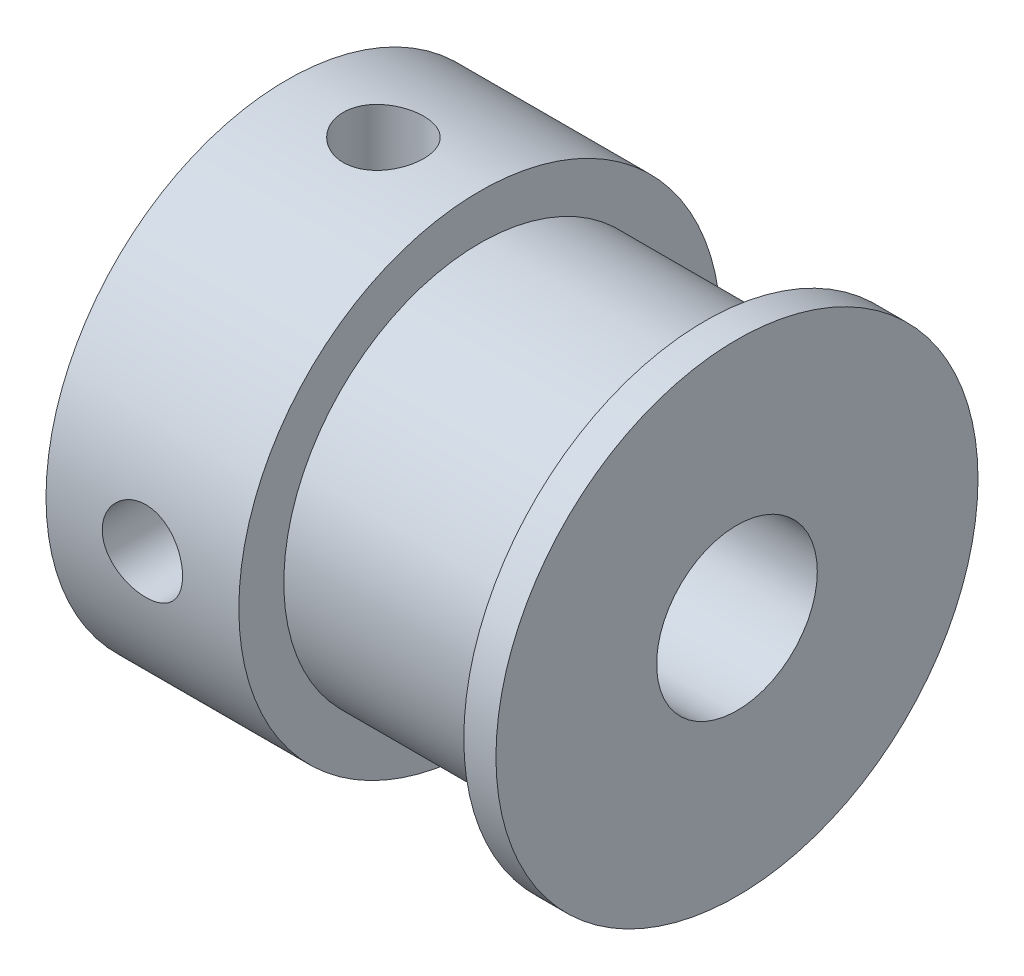
ISO-10303-21;
HEADER;
FILE_DESCRIPTION(('STEP AP214'),'2;1');
FILE_NAME('part.step','',(''),(''),'','','');
FILE_SCHEMA(('AUTOMOTIVE_DESIGN { 1 0 10303 214 1 1 1 1 }'));
ENDSEC;
DATA;
#1=APPLICATION_CONTEXT('core data for automotive mechanical design processes');
#2=APPLICATION_PROTOCOL_DEFINITION('international standard','automotive_design',2000,#1);
#3=PRODUCT_CONTEXT('',#1,'mechanical');
#4=PRODUCT('Part','Part','',(#3));
#5=PRODUCT_RELATED_PRODUCT_CATEGORY('part','',(#4));
#6=PRODUCT_DEFINITION_FORMATION('','',#4);
#7=PRODUCT_DEFINITION_CONTEXT('part definition',#1,'design');
#8=PRODUCT_DEFINITION('design','',#6,#7);
#9=PRODUCT_DEFINITION_SHAPE('','',#8);
#10=(LENGTH_UNIT() NAMED_UNIT(*) SI_UNIT(.MILLI.,.METRE.));
#11=(NAMED_UNIT(*) PLANE_ANGLE_UNIT() SI_UNIT($,.RADIAN.));
#12=(NAMED_UNIT(*) SI_UNIT($,.STERADIAN.) SOLID_ANGLE_UNIT());
#13=UNCERTAINTY_MEASURE_WITH_UNIT(LENGTH_MEASURE(1.E-05),#10,'distance_accuracy_value','');
#14=(GEOMETRIC_REPRESENTATION_CONTEXT(3) GLOBAL_UNCERTAINTY_ASSIGNED_CONTEXT((#13)) GLOBAL_UNIT_ASSIGNED_CONTEXT((#10,
#11,#12)) REPRESENTATION_CONTEXT('',''));
#15=CARTESIAN_POINT('',(0.,0.,0.));
#16=DIRECTION('',(0.,0.,1.));
#17=DIRECTION('',(1.,0.,0.));
#18=AXIS2_PLACEMENT_3D('',#15,#16,#17);
#19=CARTESIAN_POINT('',(0.,0.,0.));
#20=DIRECTION('',(1.,0.,0.));
#21=DIRECTION('',(0.,0.,-1.));
#22=AXIS2_PLACEMENT_3D('',#19,#20,#21);
#23=CYLINDRICAL_SURFACE('',#22,2.5);
#24=CARTESIAN_POINT('',(1.75000000000001,0.,2.5));
#25=CARTESIAN_POINT('',(1.75000412789938,0.0657149536912327,2.49999641755189));
#26=CARTESIAN_POINT('',(1.7552125914021,0.13150824962254,2.49738113774397));
#27=CARTESIAN_POINT('',(1.77581610042615,0.26115029408553,2.48717695046745));
#28=CARTESIAN_POINT('',(1.79123049124707,0.324995108391878,2.4795785978623));
#29=CARTESIAN_POINT('',(1.831492260771,0.448666931100716,2.4602034925414));
#30=CARTESIAN_POINT('',(1.85630298031002,0.508508503673972,2.448442989719));
#31=CARTESIAN_POINT('',(1.91446327670618,0.623090771008203,2.42182220644723));
#32=CARTESIAN_POINT('',(1.94781218031107,0.677831867487559,2.40696217041913));
#33=CARTESIAN_POINT('',(2.02439656185663,0.784384772202394,2.37445322822571));
#34=CARTESIAN_POINT('',(2.06810809904956,0.835819013902635,2.3566899890942));
#35=CARTESIAN_POINT('',(2.1631518490588,0.930974306083716,2.32074962808431));
#36=CARTESIAN_POINT('',(2.21448981471555,0.974689478883452,2.30257220261294));
#37=CARTESIAN_POINT('',(2.32810418690423,1.05656500056284,2.26623688996684));
#38=CARTESIAN_POINT('',(2.39092012293239,1.09403166943954,2.24818983712665));
#39=CARTESIAN_POINT('',(2.52295916998277,1.15771028361336,2.21607473465401));
#40=CARTESIAN_POINT('',(2.59217766090344,1.18393026870791,2.20200384508737));
#41=CARTESIAN_POINT('',(2.73083138177741,1.22266555273573,2.18072333797261));
#42=CARTESIAN_POINT('',(2.80000556508424,1.23590732135054,2.17315339479642));
#43=CARTESIAN_POINT('',(2.93997354722435,1.25053374163605,2.1647736243566));
#44=CARTESIAN_POINT('',(3.01076567608894,1.25193011046634,2.16395711679111));
#45=CARTESIAN_POINT('',(3.14285753039421,1.24335910896536,2.16888662821561));
#46=CARTESIAN_POINT('',(3.20428003902881,1.23473069942102,2.17385954577517));
#47=CARTESIAN_POINT('',(3.3246523867163,1.20867481132116,2.18845285917313));
#48=CARTESIAN_POINT('',(3.38360143163164,1.19124452987206,2.19807473539721));
#49=CARTESIAN_POINT('',(3.49903641570707,1.1477622254825,2.22109345515927));
#50=CARTESIAN_POINT('',(3.55543299848223,1.12151883389499,2.23457300829999));
#51=CARTESIAN_POINT('',(3.66329286573751,1.061302109585,2.26379255351755));
#52=CARTESIAN_POINT('',(3.71475391950011,1.02732530476558,2.27953355975239));
#53=CARTESIAN_POINT('',(3.81815156592903,0.94758256864098,2.31391447379108));
#54=CARTESIAN_POINT('',(3.86932109197019,0.900868072961596,2.33266887795933));
#55=CARTESIAN_POINT('',(3.96341927323862,0.799444473426712,2.36934529125509));
#56=CARTESIAN_POINT('',(4.00634399004235,0.744731570717852,2.38726689948501));
#57=CARTESIAN_POINT('',(4.08460707628715,0.625645632289807,2.42127484103705));
#58=CARTESIAN_POINT('',(4.11950059055717,0.560941989499257,2.43723730202509));
#59=CARTESIAN_POINT('',(4.17762128630375,0.425582769360993,2.46447351401553));
#60=CARTESIAN_POINT('',(4.20085773126895,0.354931970331593,2.47575098679441));
#61=CARTESIAN_POINT('',(4.23309425464584,0.215958114575875,2.49155417176795));
#62=CARTESIAN_POINT('',(4.24311404468347,0.147926913185404,2.4965617287664));
#63=CARTESIAN_POINT('',(4.2518309139181,0.0109744999366913,2.50091266823877));
#64=CARTESIAN_POINT('',(4.25053335704934,-0.057946274837377,2.5002587340164));
#65=CARTESIAN_POINT('',(4.23724163947655,-0.189041214982492,2.49363990316801));
#66=CARTESIAN_POINT('',(4.22608433408745,-0.251324260062442,2.48809057110237));
#67=CARTESIAN_POINT('',(4.19470241013114,-0.373008615377395,2.47277714143524));
#68=CARTESIAN_POINT('',(4.1744767919333,-0.432409607113745,2.46301257917916));
#69=CARTESIAN_POINT('',(4.12500191695853,-0.548610760562079,2.43980314267087));
#70=CARTESIAN_POINT('',(4.09551118735398,-0.605287996257689,2.42626102212424));
#71=CARTESIAN_POINT('',(4.02861558044244,-0.713076702123648,2.39679967896386));
#72=CARTESIAN_POINT('',(3.9912073317582,-0.764185787219099,2.38087944457232));
#73=CARTESIAN_POINT('',(3.9052994683339,-0.864709611613313,2.34635276671831));
#74=CARTESIAN_POINT('',(3.85607141443304,-0.913465097280795,2.32763606060552));
#75=CARTESIAN_POINT('',(3.75009356091336,-1.00232040139154,2.29077989504843));
#76=CARTESIAN_POINT('',(3.69333860147953,-1.04241423211355,2.27264084226908));
#77=CARTESIAN_POINT('',(3.57044543224961,-1.11463489312211,2.23813990282585));
#78=CARTESIAN_POINT('',(3.50398591723925,-1.14628186984829,2.2219066207934));
#79=CARTESIAN_POINT('',(3.36561241538434,-1.19760353251725,2.19467590460158));
#80=CARTESIAN_POINT('',(3.29370559187351,-1.21729364485946,2.18367172800773));
#81=CARTESIAN_POINT('',(3.15386222142319,-1.24232710931209,2.16951876260834));
#82=CARTESIAN_POINT('',(3.0862071832137,-1.24886624550107,2.16571729325614));
#83=CARTESIAN_POINT('',(2.95069116603659,-1.25086144297598,2.16456693307719));
#84=CARTESIAN_POINT('',(2.88283028907571,-1.24632230828049,2.16721524534441));
#85=CARTESIAN_POINT('',(2.75564562308498,-1.22740765699032,2.17797327562531));
#86=CARTESIAN_POINT('',(2.6961244123195,-1.21401039292849,2.18553868102992));
#87=CARTESIAN_POINT('',(2.58023985071912,-1.1789691977808,2.20463770234897));
#88=CARTESIAN_POINT('',(2.52387752238504,-1.15732261394975,2.21617259462095));
#89=CARTESIAN_POINT('',(2.41171893626674,-1.10476968162585,2.2428566295566));
#90=CARTESIAN_POINT('',(2.35621512271288,-1.07333892227057,2.25819652995239));
#91=CARTESIAN_POINT('',(2.25090682977427,-1.00268871454579,2.29044164543238));
#92=CARTESIAN_POINT('',(2.20110533685189,-0.963465214048303,2.30734767243153));
#93=CARTESIAN_POINT('',(2.10232252205298,-0.872754158330795,2.34327903949142));
#94=CARTESIAN_POINT('',(2.0541761220476,-0.820355528762707,2.36231229139336));
#95=CARTESIAN_POINT('',(1.96717127072046,-0.707693507775343,2.3984719031886));
#96=CARTESIAN_POINT('',(1.92831782571714,-0.647425904070975,2.4155972326005));
#97=CARTESIAN_POINT('',(1.86095454654725,-0.519914496024928,2.44622511981379));
#98=CARTESIAN_POINT('',(1.83251978823571,-0.452624379918263,2.45970120703636));
#99=CARTESIAN_POINT('',(1.78773979010132,-0.313427626617735,2.48126676704332));
#100=CARTESIAN_POINT('',(1.77136019146303,-0.241534749528953,2.48937154216165));
#101=CARTESIAN_POINT('',(1.7576282361552,-0.140752433104227,2.49619327387079));
#102=CARTESIAN_POINT('',(1.75477169892048,-0.112702349299371,2.49761706674002));
#103=CARTESIAN_POINT('',(1.750956668104,-0.0564396647589458,2.49952121222331));
#104=CARTESIAN_POINT('',(1.74999822691101,-0.0282270595592261,2.50000153879704));
#105=CARTESIAN_POINT('',(1.75000000000001,0.,2.5));
#106=B_SPLINE_CURVE_WITH_KNOTS('',3,(#24,#25,#26,#27,#28,#29,#30,#31,#32,#33,#34,#35,#36,#37,
#38,#39,#40,#41,#42,#43,#44,#45,#46,#47,#48,#49,#50,#51,#52,#53,#54,#55,#56,#57,#58,#59,#60,#61,
#62,#63,#64,#65,#66,#67,#68,#69,#70,#71,#72,#73,#74,#75,#76,#77,#78,#79,#80,#81,#82,#83,#84,#85,
#86,#87,#88,#89,#90,#91,#92,#93,#94,#95,#96,#97,#98,#99,#100,#101,#102,#103,#104,#105),
.UNSPECIFIED.,.T.,.F.,(4,2,2,2,2,2,2,2,2,2,2,2,2,2,2,2,2,2,2,2,2,2,2,2,2,2,2,2,2,2,2,2,2,2,2,2,
2,2,2,2,4),(0.,0.197030321775364,0.394435187136495,0.59107769436537,0.787704700726955,
0.996227198397605,1.20490779706754,1.4297715803844,1.6544743487285,1.86572515175286,
2.07676696661274,2.26257140511649,2.44843504907097,2.63862800210608,2.82890651575276,
3.04331176667346,3.25781918248356,3.48228777768049,3.70657771140347,3.9122911308918,
4.11790705639343,4.3075863313265,4.49728652038662,4.69241070034871,4.88761813435421,
5.10199513305521,5.31651985769287,5.54143352699589,5.76605639925969,5.96911634372963,
6.17208824825003,6.35572412805225,6.53941910979594,6.73545570969514,6.93159451423693,
7.15156553440619,7.37165479220712,7.59330017078652,7.81431135781158,7.89894100172117,
7.98357298143554),.UNSPECIFIED.);
#107=CARTESIAN_POINT('',(1.75000000000001,0.,2.5));
#108=VERTEX_POINT('',#107);
#109=EDGE_CURVE('E90',#108,#108,#106,.T.);
#110=ORIENTED_EDGE('',*,*,#109,.F.);
#111=EDGE_LOOP('',(#110));
#112=FACE_BOUND('',#111,.T.);
#113=CARTESIAN_POINT('',(3.,2.1650635094611,-1.25));
#114=CARTESIAN_POINT('',(3.06513476024406,2.16506918410574,-1.24999545384316));
#115=CARTESIAN_POINT('',(3.13035176440631,2.16804751484696,-1.24487496341652));
#116=CARTESIAN_POINT('',(3.25878408084644,2.17952958065066,-1.22465401237257));
#117=CARTESIAN_POINT('',(3.32199489380426,2.18804492569449,-1.20953258069272));
#118=CARTESIAN_POINT('',(3.44431458042993,2.20936683256748,-1.17012493587476));
#119=CARTESIAN_POINT('',(3.50344331559198,2.22215054341565,-1.14588744061716));
#120=CARTESIAN_POINT('',(3.6167802524959,2.25053331021072,-1.08908440672046));
#121=CARTESIAN_POINT('',(3.67098818782807,2.26613251845081,-1.05651841754472));
#122=CARTESIAN_POINT('',(3.77788216069688,2.29996086321802,-0.980833175663598));
#123=CARTESIAN_POINT('',(3.83007391959193,2.31830079547442,-0.937065045179713));
#124=CARTESIAN_POINT('',(3.92676048550839,2.35464978482132,-0.841567259518085));
#125=CARTESIAN_POINT('',(3.9712514532294,2.37265867289062,-0.789833657227866));
#126=CARTESIAN_POINT('',(4.05420893893458,2.40776846191186,-0.675611954268182));
#127=CARTESIAN_POINT('',(4.09206720982441,2.42472633022716,-0.612633986265718));
#128=CARTESIAN_POINT('',(4.1564260665572,2.45438445124411,-0.48019628324938));
#129=CARTESIAN_POINT('',(4.18293382017146,2.46708738979677,-0.410740672672694));
#130=CARTESIAN_POINT('',(4.22188082662637,2.48600576555297,-0.272556179907471));
#131=CARTESIAN_POINT('',(4.23518690794442,2.49261850276115,-0.204127238111022));
#132=CARTESIAN_POINT('',(4.2502076483438,2.50009479807584,-0.0657132858723104));
#133=CARTESIAN_POINT('',(4.25192932099464,2.50096183480737,0.00427075730467264));
#134=CARTESIAN_POINT('',(4.24406665753706,2.49703727395563,0.137290655529687));
#135=CARTESIAN_POINT('',(4.23545248059847,2.49273119865201,0.200401498970989));
#136=CARTESIAN_POINT('',(4.20889894511918,2.47967806574684,0.324142214897902));
#137=CARTESIAN_POINT('',(4.19095888877972,2.47093067582992,0.384771901367406));
#138=CARTESIAN_POINT('',(4.14614679238773,2.44964479109568,0.502886739461942));
#139=CARTESIAN_POINT('',(4.11915460853491,2.43705551911499,0.560316779393972));
#140=CARTESIAN_POINT('',(4.05717072974813,2.40922057483359,0.66997100189166));
#141=CARTESIAN_POINT('',(4.02217617087206,2.39397395196855,0.722193311048307));
#142=CARTESIAN_POINT('',(3.94138081058373,2.36055492999037,0.825217076122743));
#143=CARTESIAN_POINT('',(3.89487121459249,2.34224219997719,0.8754175937867));
#144=CARTESIAN_POINT('',(3.79426284383728,2.30567925733515,0.967630462872225));
#145=CARTESIAN_POINT('',(3.74015828465742,2.28742910332036,1.00963651446779));
#146=CARTESIAN_POINT('',(3.62168975946989,2.25180195115606,1.08688166830276));
#147=CARTESIAN_POINT('',(3.55689247118223,2.23455399988385,1.12152164372256));
#148=CARTESIAN_POINT('',(3.42132791080125,2.2046931284822,1.17914889125154));
#149=CARTESIAN_POINT('',(3.35056695872805,2.19207537557584,1.20214832276361));
#150=CARTESIAN_POINT('',(3.21098186089651,2.17430794771293,1.2339752637813));
#151=CARTESIAN_POINT('',(3.14244860119556,2.16864569810621,1.24378140264997));
#152=CARTESIAN_POINT('',(3.00449832310432,2.16397399202012,1.25189618326428));
#153=CARTESIAN_POINT('',(2.93508196360027,2.1649598361164,1.25021294664378));
#154=CARTESIAN_POINT('',(2.80543260177659,2.17292920675731,1.23629505417996));
#155=CARTESIAN_POINT('',(2.74502568611509,2.17924484383318,1.22523477089058));
#156=CARTESIAN_POINT('',(2.6270402671613,2.19617526939176,1.19462035579055));
#157=CARTESIAN_POINT('',(2.56946268656674,2.20679145006292,1.17506347327952));
#158=CARTESIAN_POINT('',(2.45573583637163,2.23170277599571,1.12705948575611));
#159=CARTESIAN_POINT('',(2.39977622893306,2.24614554053829,1.0982425796159));
#160=CARTESIAN_POINT('',(2.29316341057626,2.27695149371562,1.03285883001975));
#161=CARTESIAN_POINT('',(2.2425129456084,2.29331566693935,0.99628800541527));
#162=CARTESIAN_POINT('',(2.14127654059557,2.3285999807042,0.911046458998566));
#163=CARTESIAN_POINT('',(2.09150356160293,2.34758228942861,0.861431590393708));
#164=CARTESIAN_POINT('',(2.00073470250801,2.38417793722366,0.75425561924786));
#165=CARTESIAN_POINT('',(1.95974178721183,2.40179081259637,0.696691843319183));
#166=CARTESIAN_POINT('',(1.88678284256237,2.43426702113696,0.573169203198446));
#167=CARTESIAN_POINT('',(1.85508360223636,2.44904552090037,0.507028871967641));
#168=CARTESIAN_POINT('',(1.80357762017826,2.47354193699126,0.369402955801352));
#169=CARTESIAN_POINT('',(1.78376043579212,2.48326429595466,0.29792212674022));
#170=CARTESIAN_POINT('',(1.75828929478167,2.49584385227353,0.158724602913021));
#171=CARTESIAN_POINT('',(1.75150265515486,2.49924909885239,0.0912643048130715));
#172=CARTESIAN_POINT('',(1.748945918182,2.50052662968914,-0.0439074824390041));
#173=CARTESIAN_POINT('',(1.75317196434555,2.49840085083612,-0.111618875368858));
#174=CARTESIAN_POINT('',(1.77177050849453,2.48917461047403,-0.240672490396433));
#175=CARTESIAN_POINT('',(1.78545606157209,2.48241118334987,-0.302140397264079));
#176=CARTESIAN_POINT('',(1.82165874912871,2.46490117079279,-0.421807440229521));
#177=CARTESIAN_POINT('',(1.84417715011682,2.45415401415995,-0.480006106194385));
#178=CARTESIAN_POINT('',(1.89840881520747,2.4290741343515,-0.594279257806105));
#179=CARTESIAN_POINT('',(1.9304741540098,2.41460771498499,-0.650156428375057));
#180=CARTESIAN_POINT('',(2.00244741357381,2.38360166427283,-0.75596830226753));
#181=CARTESIAN_POINT('',(2.04235893639459,2.36706108197951,-0.805900259268633));
#182=CARTESIAN_POINT('',(2.13349642377838,2.33160762783285,-0.903642505196113));
#183=CARTESIAN_POINT('',(2.18545310934649,2.31262248764622,-0.950747105674089));
#184=CARTESIAN_POINT('',(2.29681340141221,2.27578845203566,-1.03582910924334));
#185=CARTESIAN_POINT('',(2.35622352608461,2.25794057202332,-1.07379843751257));
#186=CARTESIAN_POINT('',(2.48329580822619,2.22499506631145,-1.14053884973207));
#187=CARTESIAN_POINT('',(2.55115941391092,2.21000217820338,-1.16898133245117));
#188=CARTESIAN_POINT('',(2.69166550542472,2.1858269541044,-1.21359838688301));
#189=CARTESIAN_POINT('',(2.76429111114086,2.17662520184628,-1.22981398896918));
#190=CARTESIAN_POINT('',(2.864756694565,2.16911590752238,-1.24295875983052));
#191=CARTESIAN_POINT('',(2.89170986799735,2.1676016125644,-1.24559513120481));
#192=CARTESIAN_POINT('',(2.9457706008528,2.16557419859688,-1.24911675636245));
#193=CARTESIAN_POINT('',(2.97287817048234,2.16506114656387,-1.25000189299984));
#194=CARTESIAN_POINT('',(3.,2.1650635094611,-1.25));
#195=B_SPLINE_CURVE_WITH_KNOTS('',3,(#113,#114,#115,#116,#117,#118,#119,#120,#121,#122,#123,
#124,#125,#126,#127,#128,#129,#130,#131,#132,#133,#134,#135,#136,#137,#138,#139,#140,#141,#142,
#143,#144,#145,#146,#147,#148,#149,#150,#151,#152,#153,#154,#155,#156,#157,#158,#159,#160,#161,
#162,#163,#164,#165,#166,#167,#168,#169,#170,#171,#172,#173,#174,#175,#176,#177,#178,#179,#180,
#181,#182,#183,#184,#185,#186,#187,#188,#189,#190,#191,#192,#193,#194),.UNSPECIFIED.,.T.,.F.,(4,
2,2,2,2,2,2,2,2,2,2,2,2,2,2,2,2,2,2,2,2,2,2,2,2,2,2,2,2,2,2,2,2,2,2,2,2,2,2,2,4),(0.,
0.195290153243394,0.390991116031005,0.585660744898606,0.780340906806436,0.99107789062279,
1.20191963855464,1.42697365298454,1.65188533704864,1.86079356209919,2.0695752960755,
2.26020121855673,2.45084140646819,2.64411918413933,2.8374662418784,3.04908989321113,
3.26087560307398,3.4861105216181,3.71110967764631,3.91827863567764,4.12530116485466,
4.30967729280032,4.49411315545078,4.68709120507609,4.88016857775059,5.09758429475766,
5.31507331222752,5.53830226766207,5.76133474760964,5.96390337986858,6.16640108492464,
6.35555531089365,6.54473666890016,6.74200938399339,6.93937287625898,7.15637802312584,
7.37357428556442,7.59763436298256,7.8209391625345,7.90225168981636,7.98356965618175),.UNSPECIFIED.);
#196=CARTESIAN_POINT('',(3.,2.1650635094611,-1.25));
#197=VERTEX_POINT('',#196);
#198=EDGE_CURVE('E83',#197,#197,#195,.T.);
#199=ORIENTED_EDGE('',*,*,#198,.F.);
#200=EDGE_LOOP('',(#199));
#201=FACE_BOUND('',#200,.T.);
#202=CARTESIAN_POINT('',(14.,0.,0.));
#203=DIRECTION('',(1.,0.,0.));
#204=DIRECTION('',(0.,0.,-1.));
#205=AXIS2_PLACEMENT_3D('',#202,#203,#204);
#206=CIRCLE('',#205,2.5);
#207=CARTESIAN_POINT('',(14.,0.,-2.5));
#208=VERTEX_POINT('',#207);
#209=EDGE_CURVE('E89',#208,#208,#206,.T.);
#210=ORIENTED_EDGE('',*,*,#209,.T.);
#211=EDGE_LOOP('',(#210));
#212=FACE_BOUND('',#211,.T.);
#213=CARTESIAN_POINT('',(0.,0.,0.));
#214=DIRECTION('',(1.,0.,0.));
#215=DIRECTION('',(0.,0.,-1.));
#216=AXIS2_PLACEMENT_3D('',#213,#214,#215);
#217=CIRCLE('',#216,2.5);
#218=CARTESIAN_POINT('',(0.,0.,-2.5));
#219=VERTEX_POINT('',#218);
#220=EDGE_CURVE('E59',#219,#219,#217,.T.);
#221=ORIENTED_EDGE('',*,*,#220,.F.);
#222=EDGE_LOOP('',(#221));
#223=FACE_BOUND('',#222,.T.);
#224=ADVANCED_FACE('F44',(#112,#201,#212,#223),#23,.F.);
#225=CARTESIAN_POINT('',(0.,2.5,0.));
#226=DIRECTION('',(-1.,0.,0.));
#227=DIRECTION('',(0.,0.,1.));
#228=AXIS2_PLACEMENT_3D('',#225,#226,#227);
#229=PLANE('',#228);
#230=ORIENTED_EDGE('',*,*,#220,.T.);
#231=EDGE_LOOP('',(#230));
#232=FACE_BOUND('',#231,.T.);
#233=CARTESIAN_POINT('',(0.,0.,0.));
#234=DIRECTION('',(1.,0.,0.));
#235=DIRECTION('',(0.,0.,-1.));
#236=AXIS2_PLACEMENT_3D('',#233,#234,#235);
#237=CIRCLE('',#236,7.5);
#238=CARTESIAN_POINT('',(0.,0.,-7.5));
#239=VERTEX_POINT('',#238);
#240=EDGE_CURVE('E63',#239,#239,#237,.T.);
#241=ORIENTED_EDGE('',*,*,#240,.F.);
#242=EDGE_LOOP('',(#241));
#243=FACE_BOUND('',#242,.T.);
#244=ADVANCED_FACE('F114',(#232,#243),#229,.T.);
#245=CARTESIAN_POINT('',(0.,0.,0.));
#246=DIRECTION('',(1.,0.,0.));
#247=DIRECTION('',(0.,0.,-1.));
#248=AXIS2_PLACEMENT_3D('',#245,#246,#247);
#249=CYLINDRICAL_SURFACE('',#248,7.5);
#250=CARTESIAN_POINT('',(1.75000000000001,0.,7.5));
#251=CARTESIAN_POINT('',(1.75000279447392,-0.069695452479107,7.49999880584412));
#252=CARTESIAN_POINT('',(1.75584863748447,-0.13942894091941,7.49901838956517));
#253=CARTESIAN_POINT('',(1.77906782938267,-0.27694011083652,7.49520172470694));
#254=CARTESIAN_POINT('',(1.79645177845581,-0.344715933979622,7.49236376961945));
#255=CARTESIAN_POINT('',(1.84220772429638,-0.476302373606319,7.48515034118225));
#256=CARTESIAN_POINT('',(1.87057073282029,-0.540116184215947,7.48077612579597));
#257=CARTESIAN_POINT('',(1.9374561460262,-0.662070920988969,7.47097113541035));
#258=CARTESIAN_POINT('',(1.9759773887415,-0.720212494939292,7.46554048127217));
#259=CARTESIAN_POINT('',(2.06247754191024,-0.829736307145835,7.45416658729157));
#260=CARTESIAN_POINT('',(2.11053455731807,-0.881056451767479,7.44821935907428));
#261=CARTESIAN_POINT('',(2.21457398423641,-0.974944249329958,7.43651313438366));
#262=CARTESIAN_POINT('',(2.27055689572831,-1.01751134969548,7.43075414981334));
#263=CARTESIAN_POINT('',(2.38928548309853,-1.09293356280256,7.4200378287989));
#264=CARTESIAN_POINT('',(2.45207066840238,-1.12572727643049,7.41508564545818));
#265=CARTESIAN_POINT('',(2.58235478215032,-1.1802791827056,7.40659894897337));
#266=CARTESIAN_POINT('',(2.64985339183882,-1.2020381207828,7.40306434007154));
#267=CARTESIAN_POINT('',(2.78699013742827,-1.2337071888924,7.39785268421378));
#268=CARTESIAN_POINT('',(2.8566028682507,-1.24372451456769,7.3961588424285));
#269=CARTESIAN_POINT('',(2.99654013844174,-1.25195836264493,7.39476969468325));
#270=CARTESIAN_POINT('',(3.06686462708365,-1.25017572019449,7.39507424728607));
#271=CARTESIAN_POINT('',(3.20546393063772,-1.23494754919807,7.39763214431778));
#272=CARTESIAN_POINT('',(3.27375240177262,-1.22162244094488,7.39986536659458));
#273=CARTESIAN_POINT('',(3.40711065891456,-1.18387657020172,7.40599747605504));
#274=CARTESIAN_POINT('',(3.47218033444427,-1.15945542715986,7.40989642036636));
#275=CARTESIAN_POINT('',(3.59761441172046,-1.10008862304695,7.4189423966705));
#276=CARTESIAN_POINT('',(3.65795470304061,-1.06509295693985,7.42409533553663));
#277=CARTESIAN_POINT('',(3.77195220026919,-0.985606008778711,7.43506459207505));
#278=CARTESIAN_POINT('',(3.82560886622746,-0.941113960327138,7.44088096327143));
#279=CARTESIAN_POINT('',(3.92541304290367,-0.843241106079522,7.45261013939893));
#280=CARTESIAN_POINT('',(3.97145925927004,-0.789756981936559,7.45852324615826));
#281=CARTESIAN_POINT('',(4.05393888133267,-0.675767624490819,7.46971300698362));
#282=CARTESIAN_POINT('',(4.09037222509161,-0.615262345953207,7.47498965694873));
#283=CARTESIAN_POINT('',(4.15260111356814,-0.488852958083352,7.48431946446456));
#284=CARTESIAN_POINT('',(4.17838770966562,-0.422944362782327,7.48837159203724));
#285=CARTESIAN_POINT('',(4.21849710762298,-0.287649172801363,7.4947875150633));
#286=CARTESIAN_POINT('',(4.23282086848685,-0.218262869589732,7.49715145175237));
#287=CARTESIAN_POINT('',(4.24946067923056,-0.0788549506508106,7.49990564921343));
#288=CARTESIAN_POINT('',(4.2519157859028,-0.0088503685755048,7.50031876506392));
#289=CARTESIAN_POINT('',(4.24511932778593,0.130569886444944,7.49918737210585));
#290=CARTESIAN_POINT('',(4.23586821343312,0.199985581946019,7.49764293862059));
#291=CARTESIAN_POINT('',(4.20603757533225,0.33582808777338,7.49278413469101));
#292=CARTESIAN_POINT('',(4.18552689580493,0.402270434192688,7.48948052400655));
#293=CARTESIAN_POINT('',(4.13383274090023,0.530773442430219,7.48147232227679));
#294=CARTESIAN_POINT('',(4.10264866618236,0.592833857954856,7.4767676525601));
#295=CARTESIAN_POINT('',(4.0301744376516,0.711415344734475,7.46642258151204));
#296=CARTESIAN_POINT('',(3.98879742191637,0.76788262546857,7.46077427943511));
#297=CARTESIAN_POINT('',(3.89723134230746,0.873121792751339,7.4491923369595));
#298=CARTESIAN_POINT('',(3.84704163836166,0.921893119848286,7.44325867585773));
#299=CARTESIAN_POINT('',(3.73865122596428,1.01087138982899,7.43170087617923));
#300=CARTESIAN_POINT('',(3.68037291724279,1.05098438055685,7.42608058068553));
#301=CARTESIAN_POINT('',(3.55782351543073,1.12085115514749,7.41585764888942));
#302=CARTESIAN_POINT('',(3.49355261238625,1.1506052673849,7.4112549803301));
#303=CARTESIAN_POINT('',(3.36110513359393,1.19876916573657,7.40361726848852));
#304=CARTESIAN_POINT('',(3.29294595248475,1.21722571627397,7.40057577155532));
#305=CARTESIAN_POINT('',(3.15443993538912,1.24241772688913,7.3963885841763));
#306=CARTESIAN_POINT('',(3.08409329013397,1.24915420597308,7.39524272891361));
#307=CARTESIAN_POINT('',(2.9441474170188,1.25068643302367,7.39498366542006));
#308=CARTESIAN_POINT('',(2.87454981071236,1.24563006806259,7.39584528252825));
#309=CARTESIAN_POINT('',(2.73721037597462,1.22403991947842,7.39944890726864));
#310=CARTESIAN_POINT('',(2.66946854152907,1.20750617305623,7.40219090880607));
#311=CARTESIAN_POINT('',(2.5378207813537,1.16348724479744,7.40923678140859));
#312=CARTESIAN_POINT('',(2.47391049497199,1.13601479530021,7.41353883609835));
#313=CARTESIAN_POINT('',(2.35158216540258,1.07091350195795,7.42322184461104));
#314=CARTESIAN_POINT('',(2.29316439481394,1.03328415437427,7.428602851942));
#315=CARTESIAN_POINT('',(2.18273220844613,0.948409442186072,7.43991727022811));
#316=CARTESIAN_POINT('',(2.13080199164987,0.901055281796818,7.44585647788151));
#317=CARTESIAN_POINT('',(2.03557419776254,0.79830451569011,7.45757186180421));
#318=CARTESIAN_POINT('',(1.99227861568092,0.742906056456313,7.46334800013273));
#319=CARTESIAN_POINT('',(1.91527586590003,0.625184584820136,7.4741326482111));
#320=CARTESIAN_POINT('',(1.88163698034353,0.562816393766405,7.47913558126552));
#321=CARTESIAN_POINT('',(1.82536525769505,0.433256534689487,7.48775583800888));
#322=CARTESIAN_POINT('',(1.80272145946016,0.366069747415002,7.49137454088741));
#323=CARTESIAN_POINT('',(1.77399736293667,0.248851655022698,7.49602895416478));
#324=CARTESIAN_POINT('',(1.76501276519202,0.199529415149222,7.49751013636679));
#325=CARTESIAN_POINT('',(1.75301313107763,0.100144655159903,7.4994960799306));
#326=CARTESIAN_POINT('',(1.74999799193133,0.0500821478042465,7.50000085810321));
#327=CARTESIAN_POINT('',(1.75000000000001,0.,7.5));
#328=B_SPLINE_CURVE_WITH_KNOTS('',3,(#250,#251,#252,#253,#254,#255,#256,#257,#258,#259,#260,
#261,#262,#263,#264,#265,#266,#267,#268,#269,#270,#271,#272,#273,#274,#275,#276,#277,#278,#279,
#280,#281,#282,#283,#284,#285,#286,#287,#288,#289,#290,#291,#292,#293,#294,#295,#296,#297,#298,
#299,#300,#301,#302,#303,#304,#305,#306,#307,#308,#309,#310,#311,#312,#313,#314,#315,#316,#317,
#318,#319,#320,#321,#322,#323,#324,#325,#326,#327),.UNSPECIFIED.,.T.,.F.,(4,2,2,2,2,2,2,2,2,2,2,
2,2,2,2,2,2,2,2,2,2,2,2,2,2,2,2,2,2,2,2,2,2,2,2,2,2,2,4),(0.,0.208903292469254,
0.417998772847708,0.626923433512632,0.835824206337391,1.04651245531165,1.25721400084928,
1.46921260411919,1.6811968843809,1.89123038551711,2.10124902160442,2.30910260880203,
2.51696332512689,2.72582278316277,2.93469910340285,3.14616384955662,3.35762995817922,
3.5692734445795,3.78089922260572,3.99003941745696,4.19917156517927,4.40703903503205,
4.61491817913031,4.82463412813509,5.03436531527139,5.24626911003807,5.45816618687968,
5.66918011170883,5.88017568893306,6.08853954761347,6.29690273094063,6.50502409113108,
6.71315577514664,6.92375692096692,7.13440666939482,7.34651115803596,7.55840376065032,
7.70852124082005,7.85863613638479),.UNSPECIFIED.);
#329=CARTESIAN_POINT('',(1.75000000000001,0.,7.5));
#330=VERTEX_POINT('',#329);
#331=EDGE_CURVE('E12',#330,#330,#328,.T.);
#332=ORIENTED_EDGE('',*,*,#331,.F.);
#333=EDGE_LOOP('',(#332));
#334=FACE_BOUND('',#333,.T.);
#335=CARTESIAN_POINT('',(4.25,7.5,0.));
#336=CARTESIAN_POINT('',(4.24999720552609,7.49999880584412,-0.0696954524791073));
#337=CARTESIAN_POINT('',(4.24415136251554,7.49901838956517,-0.13942894091941));
#338=CARTESIAN_POINT('',(4.22093217061734,7.49520172470694,-0.276940110836521));
#339=CARTESIAN_POINT('',(4.2035482215442,7.49236376961945,-0.344715933979623));
#340=CARTESIAN_POINT('',(4.15779227570362,7.48515034118225,-0.476302373606321));
#341=CARTESIAN_POINT('',(4.12942926717971,7.48077612579596,-0.54011618421595));
#342=CARTESIAN_POINT('',(4.0625438539738,7.47097113541035,-0.662070920988972));
#343=CARTESIAN_POINT('',(4.0240226112585,7.46554048127217,-0.720212494939295));
#344=CARTESIAN_POINT('',(3.93752245808977,7.45416658729156,-0.829736307145839));
#345=CARTESIAN_POINT('',(3.88946544268193,7.44821935907428,-0.881056451767483));
#346=CARTESIAN_POINT('',(3.78542601576359,7.43651313438366,-0.974944249329963));
#347=CARTESIAN_POINT('',(3.72944310427169,7.43075414981334,-1.01751134969548));
#348=CARTESIAN_POINT('',(3.61071451690147,7.4200378287989,-1.09293356280257));
#349=CARTESIAN_POINT('',(3.54792933159762,7.41508564545818,-1.1257272764305));
#350=CARTESIAN_POINT('',(3.41764521784969,7.40659894897337,-1.18027918270561));
#351=CARTESIAN_POINT('',(3.35014660816118,7.40306434007154,-1.20203812078281));
#352=CARTESIAN_POINT('',(3.21300986257173,7.39785268421378,-1.2337071888924));
#353=CARTESIAN_POINT('',(3.1433971317493,7.3961588424285,-1.2437245145677));
#354=CARTESIAN_POINT('',(3.00345986155826,7.39476969468325,-1.25195836264494));
#355=CARTESIAN_POINT('',(2.93313537291635,7.39507424728607,-1.2501757201945));
#356=CARTESIAN_POINT('',(2.79453606936228,7.39763214431777,-1.23494754919808));
#357=CARTESIAN_POINT('',(2.72624759822738,7.39986536659458,-1.22162244094489));
#358=CARTESIAN_POINT('',(2.59288934108543,7.40599747605504,-1.18387657020172));
#359=CARTESIAN_POINT('',(2.52781966555573,7.40989642036636,-1.15945542715987));
#360=CARTESIAN_POINT('',(2.40238558827954,7.4189423966705,-1.10008862304696));
#361=CARTESIAN_POINT('',(2.34204529695939,7.42409533553663,-1.06509295693986));
#362=CARTESIAN_POINT('',(2.22804779973081,7.43506459207504,-0.985606008778716));
#363=CARTESIAN_POINT('',(2.17439113377253,7.44088096327143,-0.941113960327143));
#364=CARTESIAN_POINT('',(2.07458695709633,7.45261013939893,-0.843241106079526));
#365=CARTESIAN_POINT('',(2.02854074072996,7.45852324615826,-0.789756981936563));
#366=CARTESIAN_POINT('',(1.94606111866733,7.46971300698362,-0.675767624490822));
#367=CARTESIAN_POINT('',(1.90962777490839,7.47498965694873,-0.61526234595321));
#368=CARTESIAN_POINT('',(1.84739888643186,7.48431946446456,-0.488852958083355));
#369=CARTESIAN_POINT('',(1.82161229033437,7.48837159203724,-0.42294436278233));
#370=CARTESIAN_POINT('',(1.78150289237701,7.4947875150633,-0.287649172801365));
#371=CARTESIAN_POINT('',(1.76717913151314,7.49715145175237,-0.218262869589734));
#372=CARTESIAN_POINT('',(1.75053932076943,7.49990564921343,-0.0788549506508116));
#373=CARTESIAN_POINT('',(1.7480842140972,7.50031876506392,-0.00885036857550548));
#374=CARTESIAN_POINT('',(1.75488067221406,7.49918737210585,0.130569886444944));
#375=CARTESIAN_POINT('',(1.76413178656687,7.49764293862059,0.199985581946019));
#376=CARTESIAN_POINT('',(1.79396242466774,7.49278413469101,0.335828087773382));
#377=CARTESIAN_POINT('',(1.81447310419506,7.48948052400655,0.402270434192689));
#378=CARTESIAN_POINT('',(1.86616725909977,7.48147232227679,0.530773442430221));
#379=CARTESIAN_POINT('',(1.89735133381764,7.4767676525601,0.592833857954859));
#380=CARTESIAN_POINT('',(1.96982556234839,7.46642258151204,0.711415344734479));
#381=CARTESIAN_POINT('',(2.01120257808363,7.46077427943511,0.767882625468573));
#382=CARTESIAN_POINT('',(2.10276865769253,7.4491923369595,0.873121792751343));
#383=CARTESIAN_POINT('',(2.15295836163834,7.44325867585773,0.921893119848291));
#384=CARTESIAN_POINT('',(2.26134877403571,7.43170087617923,1.010871389829));
#385=CARTESIAN_POINT('',(2.31962708275721,7.42608058068553,1.05098438055686));
#386=CARTESIAN_POINT('',(2.44217648456927,7.41585764888942,1.12085115514749));
#387=CARTESIAN_POINT('',(2.50644738761375,7.4112549803301,1.15060526738491));
#388=CARTESIAN_POINT('',(2.63889486640607,7.40361726848852,1.19876916573657));
#389=CARTESIAN_POINT('',(2.70705404751524,7.40057577155532,1.21722571627397));
#390=CARTESIAN_POINT('',(2.84556006461088,7.3963885841763,1.24241772688914));
#391=CARTESIAN_POINT('',(2.91590670986603,7.39524272891361,1.24915420597308));
#392=CARTESIAN_POINT('',(3.0558525829812,7.39498366542006,1.25068643302368));
#393=CARTESIAN_POINT('',(3.12545018928764,7.39584528252825,1.24563006806259));
#394=CARTESIAN_POINT('',(3.26278962402538,7.39944890726864,1.22403991947842));
#395=CARTESIAN_POINT('',(3.33053145847094,7.40219090880607,1.20750617305624));
#396=CARTESIAN_POINT('',(3.46217921864631,7.40923678140859,1.16348724479745));
#397=CARTESIAN_POINT('',(3.52608950502801,7.41353883609835,1.13601479530022));
#398=CARTESIAN_POINT('',(3.64841783459742,7.42322184461104,1.07091350195795));
#399=CARTESIAN_POINT('',(3.70683560518607,7.428602851942,1.03328415437428));
#400=CARTESIAN_POINT('',(3.81726779155388,7.43991727022811,0.948409442186077));
#401=CARTESIAN_POINT('',(3.86919800835014,7.44585647788151,0.901055281796823));
#402=CARTESIAN_POINT('',(3.96442580223747,7.4575718618042,0.798304515690114));
#403=CARTESIAN_POINT('',(4.00772138431909,7.46334800013273,0.742906056456317));
#404=CARTESIAN_POINT('',(4.08472413409997,7.4741326482111,0.62518458482014));
#405=CARTESIAN_POINT('',(4.11836301965648,7.47913558126552,0.562816393766409));
#406=CARTESIAN_POINT('',(4.17463474230496,7.48775583800888,0.43325653468949));
#407=CARTESIAN_POINT('',(4.19727854053985,7.49137454088741,0.366069747415004));
#408=CARTESIAN_POINT('',(4.22600263706333,7.49602895416478,0.2488516550227));
#409=CARTESIAN_POINT('',(4.23498723480798,7.49751013636679,0.199529415149223));
#410=CARTESIAN_POINT('',(4.24698686892238,7.4994960799306,0.100144655159904));
#411=CARTESIAN_POINT('',(4.25000200806868,7.50000085810321,0.050082147804247));
#412=CARTESIAN_POINT('',(4.25,7.5,0.));
#413=B_SPLINE_CURVE_WITH_KNOTS('',3,(#335,#336,#337,#338,#339,#340,#341,#342,#343,#344,#345,
#346,#347,#348,#349,#350,#351,#352,#353,#354,#355,#356,#357,#358,#359,#360,#361,#362,#363,#364,
#365,#366,#367,#368,#369,#370,#371,#372,#373,#374,#375,#376,#377,#378,#379,#380,#381,#382,#383,
#384,#385,#386,#387,#388,#389,#390,#391,#392,#393,#394,#395,#396,#397,#398,#399,#400,#401,#402,
#403,#404,#405,#406,#407,#408,#409,#410,#411,#412),.UNSPECIFIED.,.T.,.F.,(4,2,2,2,2,2,2,2,2,2,2,
2,2,2,2,2,2,2,2,2,2,2,2,2,2,2,2,2,2,2,2,2,2,2,2,2,2,2,4),(0.,0.208903292469254,0.41799877284771,
0.626923433512634,0.835824206337395,1.04651245531166,1.25721400084928,1.4692126041192,
1.6811968843809,1.89123038551712,2.10124902160443,2.30910260880204,2.5169633251269,
2.72582278316278,2.93469910340286,3.14616384955663,3.35762995817923,3.56927344457951,
3.78089922260574,3.99003941745698,4.19917156517929,4.40703903503207,4.61491817913033,
4.82463412813511,5.03436531527141,5.24626911003809,5.45816618687971,5.66918011170886,
5.88017568893308,6.0885395476135,6.29690273094066,6.50502409113111,6.71315577514667,
6.92375692096695,7.13440666939486,7.34651115803599,7.55840376065035,7.70852124082008,
7.85863613638483),.UNSPECIFIED.);
#414=CARTESIAN_POINT('',(4.25,7.5,0.));
#415=VERTEX_POINT('',#414);
#416=EDGE_CURVE('E55',#415,#415,#413,.T.);
#417=ORIENTED_EDGE('',*,*,#416,.F.);
#418=EDGE_LOOP('',(#417));
#419=FACE_BOUND('',#418,.T.);
#420=ORIENTED_EDGE('',*,*,#240,.T.);
#421=EDGE_LOOP('',(#420));
#422=FACE_BOUND('',#421,.T.);
#423=CARTESIAN_POINT('',(6.,0.,0.));
#424=DIRECTION('',(1.,0.,0.));
#425=DIRECTION('',(0.,0.,-1.));
#426=AXIS2_PLACEMENT_3D('',#423,#424,#425);
#427=CIRCLE('',#426,7.5);
#428=CARTESIAN_POINT('',(6.,0.,-7.5));
#429=VERTEX_POINT('',#428);
#430=EDGE_CURVE('E107',#429,#429,#427,.T.);
#431=ORIENTED_EDGE('',*,*,#430,.F.);
#432=EDGE_LOOP('',(#431));
#433=FACE_BOUND('',#432,.T.);
#434=ADVANCED_FACE('F69',(#334,#419,#422,#433),#249,.T.);
#435=CARTESIAN_POINT('',(6.,7.5,0.));
#436=DIRECTION('',(1.,0.,0.));
#437=DIRECTION('',(0.,0.,-1.));
#438=AXIS2_PLACEMENT_3D('',#435,#436,#437);
#439=PLANE('',#438);
#440=ORIENTED_EDGE('',*,*,#430,.T.);
#441=EDGE_LOOP('',(#440));
#442=FACE_BOUND('',#441,.T.);
#443=CARTESIAN_POINT('',(6.,0.,0.));
#444=DIRECTION('',(1.,0.,0.));
#445=DIRECTION('',(0.,0.,-1.));
#446=AXIS2_PLACEMENT_3D('',#443,#444,#445);
#447=CIRCLE('',#446,6.1);
#448=CARTESIAN_POINT('',(6.,0.,-6.1));
#449=VERTEX_POINT('',#448);
#450=EDGE_CURVE('E104',#449,#449,#447,.T.);
#451=ORIENTED_EDGE('',*,*,#450,.F.);
#452=EDGE_LOOP('',(#451));
#453=FACE_BOUND('',#452,.T.);
#454=ADVANCED_FACE('F121',(#442,#453),#439,.T.);
#455=CARTESIAN_POINT('',(0.,0.,0.));
#456=DIRECTION('',(1.,0.,0.));
#457=DIRECTION('',(0.,0.,-1.));
#458=AXIS2_PLACEMENT_3D('',#455,#456,#457);
#459=CYLINDRICAL_SURFACE('',#458,6.1);
#460=ORIENTED_EDGE('',*,*,#450,.T.);
#461=EDGE_LOOP('',(#460));
#462=FACE_BOUND('',#461,.T.);
#463=CARTESIAN_POINT('',(13.,0.,0.));
#464=DIRECTION('',(1.,0.,0.));
#465=DIRECTION('',(0.,0.,-1.));
#466=AXIS2_PLACEMENT_3D('',#463,#464,#465);
#467=CIRCLE('',#466,6.1);
#468=CARTESIAN_POINT('',(13.,0.,-6.1));
#469=VERTEX_POINT('',#468);
#470=EDGE_CURVE('E101',#469,#469,#467,.T.);
#471=ORIENTED_EDGE('',*,*,#470,.F.);
#472=EDGE_LOOP('',(#471));
#473=FACE_BOUND('',#472,.T.);
#474=ADVANCED_FACE('F148',(#462,#473),#459,.T.);
#475=CARTESIAN_POINT('',(13.,6.1,0.));
#476=DIRECTION('',(-1.,0.,0.));
#477=DIRECTION('',(0.,0.,1.));
#478=AXIS2_PLACEMENT_3D('',#475,#476,#477);
#479=PLANE('',#478);
#480=ORIENTED_EDGE('',*,*,#470,.T.);
#481=EDGE_LOOP('',(#480));
#482=FACE_BOUND('',#481,.T.);
#483=CARTESIAN_POINT('',(13.,0.,0.));
#484=DIRECTION('',(1.,0.,0.));
#485=DIRECTION('',(0.,0.,-1.));
#486=AXIS2_PLACEMENT_3D('',#483,#484,#485);
#487=CIRCLE('',#486,7.5);
#488=CARTESIAN_POINT('',(13.,0.,-7.5));
#489=VERTEX_POINT('',#488);
#490=EDGE_CURVE('E98',#489,#489,#487,.T.);
#491=ORIENTED_EDGE('',*,*,#490,.F.);
#492=EDGE_LOOP('',(#491));
#493=FACE_BOUND('',#492,.T.);
#494=ADVANCED_FACE('F141',(#482,#493),#479,.T.);
#495=CARTESIAN_POINT('',(0.,0.,0.));
#496=DIRECTION('',(1.,0.,0.));
#497=DIRECTION('',(0.,0.,-1.));
#498=AXIS2_PLACEMENT_3D('',#495,#496,#497);
#499=CYLINDRICAL_SURFACE('',#498,7.5);
#500=ORIENTED_EDGE('',*,*,#490,.T.);
#501=EDGE_LOOP('',(#500));
#502=FACE_BOUND('',#501,.T.);
#503=CARTESIAN_POINT('',(14.,0.,0.));
#504=DIRECTION('',(1.,0.,0.));
#505=DIRECTION('',(0.,0.,-1.));
#506=AXIS2_PLACEMENT_3D('',#503,#504,#505);
#507=CIRCLE('',#506,7.5);
#508=CARTESIAN_POINT('',(14.,0.,-7.5));
#509=VERTEX_POINT('',#508);
#510=EDGE_CURVE('E95',#509,#509,#507,.T.);
#511=ORIENTED_EDGE('',*,*,#510,.F.);
#512=EDGE_LOOP('',(#511));
#513=FACE_BOUND('',#512,.T.);
#514=ADVANCED_FACE('F136',(#502,#513),#499,.T.);
#515=CARTESIAN_POINT('',(14.,7.5,0.));
#516=DIRECTION('',(1.,0.,0.));
#517=DIRECTION('',(0.,0.,-1.));
#518=AXIS2_PLACEMENT_3D('',#515,#516,#517);
#519=PLANE('',#518);
#520=ORIENTED_EDGE('',*,*,#510,.T.);
#521=EDGE_LOOP('',(#520));
#522=FACE_BOUND('',#521,.T.);
#523=ORIENTED_EDGE('',*,*,#209,.F.);
#524=EDGE_LOOP('',(#523));
#525=FACE_BOUND('',#524,.T.);
#526=ADVANCED_FACE('F77',(#522,#525),#519,.T.);
#527=CARTESIAN_POINT('',(3.,0.,0.));
#528=DIRECTION('',(0.,-1.,0.));
#529=DIRECTION('',(0.,0.,-1.));
#530=AXIS2_PLACEMENT_3D('',#527,#528,#529);
#531=CYLINDRICAL_SURFACE('',#530,1.25);
#532=ORIENTED_EDGE('',*,*,#198,.T.);
#533=EDGE_LOOP('',(#532));
#534=FACE_BOUND('',#533,.T.);
#535=ORIENTED_EDGE('',*,*,#416,.T.);
#536=EDGE_LOOP('',(#535));
#537=FACE_BOUND('',#536,.T.);
#538=ADVANCED_FACE('F72',(#534,#537),#531,.F.);
#539=CARTESIAN_POINT('',(3.,0.,0.));
#540=DIRECTION('',(0.,0.,-1.));
#541=DIRECTION('',(-1.,0.,0.));
#542=AXIS2_PLACEMENT_3D('',#539,#540,#541);
#543=CYLINDRICAL_SURFACE('',#542,1.24999999999999);
#544=ORIENTED_EDGE('',*,*,#109,.T.);
#545=EDGE_LOOP('',(#544));
#546=FACE_BOUND('',#545,.T.);
#547=ORIENTED_EDGE('',*,*,#331,.T.);
#548=EDGE_LOOP('',(#547));
#549=FACE_BOUND('',#548,.T.);
#550=ADVANCED_FACE('F76',(#546,#549),#543,.F.);
#551=CLOSED_SHELL('',(#224,#244,#434,#454,#474,#494,#514,#526,#538,#550));
#552=MANIFOLD_SOLID_BREP('B2',#551);
#553=ADVANCED_BREP_SHAPE_REPRESENTATION('',(#18,#552),#14);
#554=SHAPE_DEFINITION_REPRESENTATION(#9,#553);
ENDSEC;
END-ISO-10303-21;
